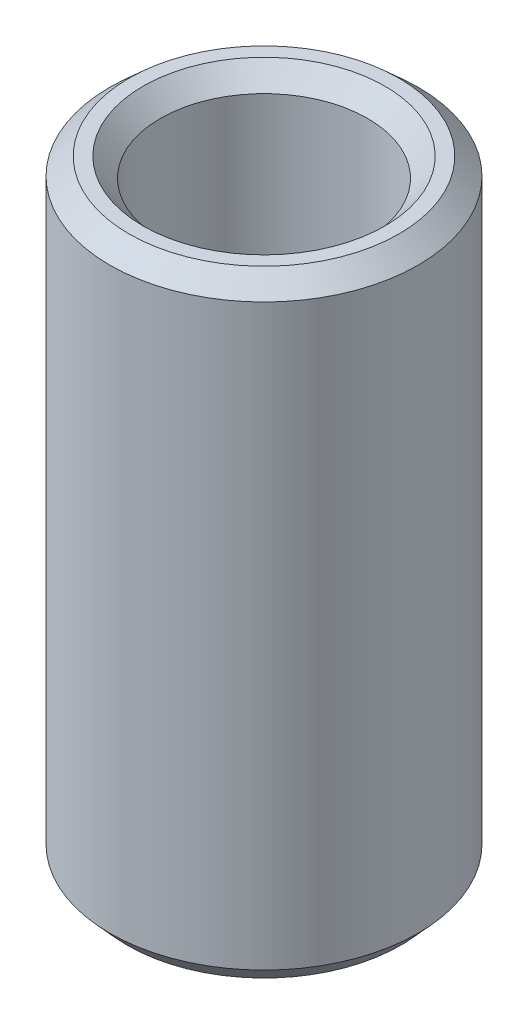
ISO-10303-21;
HEADER;
FILE_DESCRIPTION(('STEP AP214'),'2;1');
FILE_NAME('part.step','',(''),(''),'','','');
FILE_SCHEMA(('AUTOMOTIVE_DESIGN { 1 0 10303 214 1 1 1 1 }'));
ENDSEC;
DATA;
#1=APPLICATION_CONTEXT('core data for automotive mechanical design processes');
#2=APPLICATION_PROTOCOL_DEFINITION('international standard','automotive_design',2000,#1);
#3=PRODUCT_CONTEXT('',#1,'mechanical');
#4=PRODUCT('Part','Part','',(#3));
#5=PRODUCT_RELATED_PRODUCT_CATEGORY('part','',(#4));
#6=PRODUCT_DEFINITION_FORMATION('','',#4);
#7=PRODUCT_DEFINITION_CONTEXT('part definition',#1,'design');
#8=PRODUCT_DEFINITION('design','',#6,#7);
#9=PRODUCT_DEFINITION_SHAPE('','',#8);
#10=(LENGTH_UNIT() NAMED_UNIT(*) SI_UNIT(.MILLI.,.METRE.));
#11=(NAMED_UNIT(*) PLANE_ANGLE_UNIT() SI_UNIT($,.RADIAN.));
#12=(NAMED_UNIT(*) SI_UNIT($,.STERADIAN.) SOLID_ANGLE_UNIT());
#13=UNCERTAINTY_MEASURE_WITH_UNIT(LENGTH_MEASURE(1.E-05),#10,'distance_accuracy_value','');
#14=(GEOMETRIC_REPRESENTATION_CONTEXT(3) GLOBAL_UNCERTAINTY_ASSIGNED_CONTEXT((#13)) GLOBAL_UNIT_ASSIGNED_CONTEXT((#10,
#11,#12)) REPRESENTATION_CONTEXT('',''));
#15=CARTESIAN_POINT('',(0.,0.,0.));
#16=DIRECTION('',(0.,0.,1.));
#17=DIRECTION('',(1.,0.,0.));
#18=AXIS2_PLACEMENT_3D('',#15,#16,#17);
#19=CARTESIAN_POINT('',(0.,119.736719964159,0.));
#20=DIRECTION('',(0.,-1.,0.));
#21=DIRECTION('',(0.,0.,-1.));
#22=AXIS2_PLACEMENT_3D('',#19,#20,#21);
#23=CYLINDRICAL_SURFACE('',#22,30.);
#24=CARTESIAN_POINT('',(0.,3.7350255753613,0.));
#25=DIRECTION('',(0.,1.,0.));
#26=DIRECTION('',(0.,0.,1.));
#27=AXIS2_PLACEMENT_3D('',#24,#25,#26);
#28=CIRCLE('',#27,30.);
#29=CARTESIAN_POINT('',(0.,3.73502557536129,-30.));
#30=VERTEX_POINT('',#29);
#31=EDGE_CURVE('E10',#30,#30,#28,.T.);
#32=CARTESIAN_POINT('',(0.,116.346304996092,0.));
#33=DIRECTION('',(0.,1.,0.));
#34=DIRECTION('',(0.,0.,1.));
#35=AXIS2_PLACEMENT_3D('',#32,#33,#34);
#36=CIRCLE('',#35,30.);
#37=CARTESIAN_POINT('',(0.,116.346304996092,-30.));
#38=VERTEX_POINT('',#37);
#39=EDGE_CURVE('E50',#38,#38,#36,.F.);
#40=CARTESIAN_POINT('',(0.,3.73502557536129,-30.));
#41=CARTESIAN_POINT('',(0.,4.90805973599389,-30.));
#42=CARTESIAN_POINT('',(0.,6.0810938966265,-30.));
#43=CARTESIAN_POINT('',(0.,8.42716221789172,-30.));
#44=CARTESIAN_POINT('',(0.,9.60019637852433,-30.));
#45=CARTESIAN_POINT('',(0.,11.9462646997895,-30.));
#46=CARTESIAN_POINT('',(0.,13.1192988604222,-30.));
#47=CARTESIAN_POINT('',(0.,15.4653671816874,-30.));
#48=CARTESIAN_POINT('',(0.,16.63840134232,-30.));
#49=CARTESIAN_POINT('',(0.,18.9844696635852,-30.));
#50=CARTESIAN_POINT('',(0.,20.1575038242178,-30.));
#51=CARTESIAN_POINT('',(0.,22.503572145483,-30.));
#52=CARTESIAN_POINT('',(0.,23.6766063061156,-30.));
#53=CARTESIAN_POINT('',(0.,26.0226746273809,-30.));
#54=CARTESIAN_POINT('',(0.,27.1957087880135,-30.));
#55=CARTESIAN_POINT('',(0.,29.5417771092787,-30.));
#56=CARTESIAN_POINT('',(0.,30.7148112699113,-30.));
#57=CARTESIAN_POINT('',(0.,33.0608795911765,-30.));
#58=CARTESIAN_POINT('',(0.,34.2339137518091,-30.));
#59=CARTESIAN_POINT('',(0.,36.5799820730743,-30.));
#60=CARTESIAN_POINT('',(0.,37.7530162337069,-30.));
#61=CARTESIAN_POINT('',(0.,40.0990845549722,-30.));
#62=CARTESIAN_POINT('',(0.,41.2721187156048,-30.));
#63=CARTESIAN_POINT('',(0.,43.61818703687,-30.));
#64=CARTESIAN_POINT('',(0.,44.7912211975026,-30.));
#65=CARTESIAN_POINT('',(0.,47.1372895187678,-30.));
#66=CARTESIAN_POINT('',(0.,48.3103236794004,-30.));
#67=CARTESIAN_POINT('',(0.,50.6563920006656,-30.));
#68=CARTESIAN_POINT('',(0.,51.8294261612982,-30.));
#69=CARTESIAN_POINT('',(0.,54.1754944825635,-30.));
#70=CARTESIAN_POINT('',(0.,55.3485286431961,-30.));
#71=CARTESIAN_POINT('',(0.,57.6945969644613,-30.));
#72=CARTESIAN_POINT('',(0.,58.8676311250939,-30.));
#73=CARTESIAN_POINT('',(0.,61.2136994463591,-30.));
#74=CARTESIAN_POINT('',(0.,62.3867336069917,-30.));
#75=CARTESIAN_POINT('',(0.,64.7328019282569,-30.));
#76=CARTESIAN_POINT('',(0.,65.9058360888895,-30.));
#77=CARTESIAN_POINT('',(0.,68.2519044101548,-30.));
#78=CARTESIAN_POINT('',(0.,69.4249385707874,-30.));
#79=CARTESIAN_POINT('',(0.,71.7710068920526,-30.));
#80=CARTESIAN_POINT('',(0.,72.9440410526852,-30.));
#81=CARTESIAN_POINT('',(0.,75.2901093739504,-30.));
#82=CARTESIAN_POINT('',(0.,76.463143534583,-30.));
#83=CARTESIAN_POINT('',(0.,78.8092118558482,-30.));
#84=CARTESIAN_POINT('',(0.,79.9822460164809,-30.));
#85=CARTESIAN_POINT('',(0.,82.3283143377461,-30.));
#86=CARTESIAN_POINT('',(0.,83.5013484983787,-30.));
#87=CARTESIAN_POINT('',(0.,85.8474168196439,-30.));
#88=CARTESIAN_POINT('',(0.,87.0204509802765,-30.));
#89=CARTESIAN_POINT('',(0.,89.3665193015417,-30.));
#90=CARTESIAN_POINT('',(0.,90.5395534621743,-30.));
#91=CARTESIAN_POINT('',(0.,92.8856217834395,-30.));
#92=CARTESIAN_POINT('',(0.,94.0586559440721,-30.));
#93=CARTESIAN_POINT('',(0.,96.4047242653374,-30.));
#94=CARTESIAN_POINT('',(0.,97.57775842597,-30.));
#95=CARTESIAN_POINT('',(0.,99.9238267472352,-30.));
#96=CARTESIAN_POINT('',(0.,101.096860907868,-30.));
#97=CARTESIAN_POINT('',(0.,103.442929229133,-30.));
#98=CARTESIAN_POINT('',(0.,104.615963389766,-30.));
#99=CARTESIAN_POINT('',(0.,106.962031711031,-30.));
#100=CARTESIAN_POINT('',(0.,108.135065871663,-30.));
#101=CARTESIAN_POINT('',(0.,110.481134192929,-30.));
#102=CARTESIAN_POINT('',(0.,111.654168353561,-30.));
#103=CARTESIAN_POINT('',(0.,114.000236674826,-30.));
#104=CARTESIAN_POINT('',(0.,115.173270835459,-30.));
#105=CARTESIAN_POINT('',(0.,116.346304996092,-30.));
#106=B_SPLINE_CURVE_WITH_KNOTS('',3,(#40,#41,#42,#43,#44,#45,#46,#47,#48,#49,#50,#51,#52,#53,
#54,#55,#56,#57,#58,#59,#60,#61,#62,#63,#64,#65,#66,#67,#68,#69,#70,#71,#72,#73,#74,#75,#76,#77,
#78,#79,#80,#81,#82,#83,#84,#85,#86,#87,#88,#89,#90,#91,#92,#93,#94,#95,#96,#97,#98,#99,#100,
#101,#102,#103,#104,#105),.UNSPECIFIED.,.F.,.F.,(4,2,2,2,2,2,2,2,2,2,2,2,2,2,2,2,2,2,2,2,2,2,2,
2,2,2,2,2,2,2,2,2,4),(0.,3.51910248189782,7.03820496379565,10.5573074456935,14.0764099275913,
17.5955124094891,21.114614891387,24.6337173732848,28.1528198551826,31.6719223370804,
35.1910248189783,38.7101273008761,42.2292297827739,45.7483322646717,49.2674347465696,
52.7865372284674,56.3056397103652,59.824742192263,63.3438446741608,66.8629471560587,
70.3820496379565,73.9011521198543,77.4202546017522,80.93935708365,84.4584595655478,
87.9775620474456,91.4966645293435,95.0157670112413,98.5348694931391,102.053971975037,
105.573074456935,109.092176938833,112.61127942073),.UNSPECIFIED.);
#107=EDGE_CURVE('BSEAM39',#30,#38,#106,.T.);
#108=ORIENTED_EDGE('',*,*,#31,.T.);
#109=ORIENTED_EDGE('',*,*,#39,.T.);
#110=ORIENTED_EDGE('',*,*,#107,.T.);
#111=ORIENTED_EDGE('',*,*,#107,.F.);
#112=EDGE_LOOP('',(#108,#110,#109,#111));
#113=FACE_BOUND('',#112,.T.);
#114=ADVANCED_FACE('F39',(#113),#23,.T.);
#115=CARTESIAN_POINT('',(0.,119.736719964159,0.));
#116=DIRECTION('',(0.,1.,0.));
#117=DIRECTION('',(0.,0.,1.));
#118=AXIS2_PLACEMENT_3D('',#115,#116,#117);
#119=PLANE('',#118);
#120=CARTESIAN_POINT('',(0.,119.736719964159,0.));
#121=DIRECTION('',(0.,1.,0.));
#122=DIRECTION('',(0.,0.,1.));
#123=AXIS2_PLACEMENT_3D('',#120,#121,#122);
#124=CIRCLE('',#123,23.5586092635008);
#125=CARTESIAN_POINT('',(0.,119.736719964159,23.5586092635008));
#126=VERTEX_POINT('',#125);
#127=EDGE_CURVE('E58',#126,#126,#124,.F.);
#128=ORIENTED_EDGE('',*,*,#127,.T.);
#129=EDGE_LOOP('',(#128));
#130=FACE_BOUND('',#129,.T.);
#131=CARTESIAN_POINT('',(0.,119.736719964159,0.));
#132=DIRECTION('',(0.,1.,0.));
#133=DIRECTION('',(0.,0.,1.));
#134=AXIS2_PLACEMENT_3D('',#131,#132,#133);
#135=CIRCLE('',#134,26.2649744246389);
#136=CARTESIAN_POINT('',(0.,119.736719964159,26.2649744246389));
#137=VERTEX_POINT('',#136);
#138=EDGE_CURVE('E61',#137,#137,#135,.T.);
#139=ORIENTED_EDGE('',*,*,#138,.T.);
#140=EDGE_LOOP('',(#139));
#141=FACE_BOUND('',#140,.T.);
#142=ADVANCED_FACE('F88',(#130,#141),#119,.T.);
#143=CARTESIAN_POINT('',(0.,0.,0.));
#144=DIRECTION('',(0.,1.,0.));
#145=DIRECTION('',(0.,0.,1.));
#146=AXIS2_PLACEMENT_3D('',#143,#144,#145);
#147=PLANE('',#146);
#148=CARTESIAN_POINT('',(0.,0.,0.));
#149=DIRECTION('',(0.,1.,0.));
#150=DIRECTION('',(0.,0.,1.));
#151=AXIS2_PLACEMENT_3D('',#148,#149,#150);
#152=CIRCLE('',#151,23.903219870795);
#153=CARTESIAN_POINT('',(0.,0.,-23.903219870795));
#154=VERTEX_POINT('',#153);
#155=EDGE_CURVE('E51',#154,#154,#152,.T.);
#156=ORIENTED_EDGE('',*,*,#155,.T.);
#157=EDGE_LOOP('',(#156));
#158=FACE_BOUND('',#157,.T.);
#159=CARTESIAN_POINT('',(0.,0.,0.));
#160=DIRECTION('',(0.,1.,0.));
#161=DIRECTION('',(0.,0.,1.));
#162=AXIS2_PLACEMENT_3D('',#159,#160,#161);
#163=CIRCLE('',#162,26.6095850319329);
#164=CARTESIAN_POINT('',(0.,0.,26.6095850319329));
#165=VERTEX_POINT('',#164);
#166=EDGE_CURVE('E54',#165,#165,#163,.F.);
#167=ORIENTED_EDGE('',*,*,#166,.T.);
#168=EDGE_LOOP('',(#167));
#169=FACE_BOUND('',#168,.T.);
#170=ADVANCED_FACE('F83',(#158,#169),#147,.F.);
#171=CARTESIAN_POINT('',(0.,119.736719964159,0.));
#172=DIRECTION('',(0.,-1.,0.));
#173=DIRECTION('',(0.,0.,-1.));
#174=AXIS2_PLACEMENT_3D('',#171,#172,#173);
#175=CYLINDRICAL_SURFACE('',#174,20.1681942954338);
#176=CARTESIAN_POINT('',(0.,116.001694388797,0.));
#177=DIRECTION('',(0.,1.,0.));
#178=DIRECTION('',(0.,0.,1.));
#179=AXIS2_PLACEMENT_3D('',#176,#177,#178);
#180=CIRCLE('',#179,20.1681942954338);
#181=CARTESIAN_POINT('',(0.,116.001694388797,-20.1681942954338));
#182=VERTEX_POINT('',#181);
#183=EDGE_CURVE('E67',#182,#182,#180,.T.);
#184=CARTESIAN_POINT('',(0.,3.390414968067,0.));
#185=DIRECTION('',(0.,1.,0.));
#186=DIRECTION('',(0.,0.,1.));
#187=AXIS2_PLACEMENT_3D('',#184,#185,#186);
#188=CIRCLE('',#187,20.1681942954338);
#189=CARTESIAN_POINT('',(0.,3.390414968067,-20.1681942954338));
#190=VERTEX_POINT('',#189);
#191=EDGE_CURVE('E69',#190,#190,#188,.F.);
#192=CARTESIAN_POINT('',(0.,116.001694388797,-20.1681942954338));
#193=CARTESIAN_POINT('',(0.,114.828660228165,-20.1681942954338));
#194=CARTESIAN_POINT('',(0.,113.655626067532,-20.1681942954338));
#195=CARTESIAN_POINT('',(0.,111.309557746267,-20.1681942954338));
#196=CARTESIAN_POINT('',(0.,110.136523585634,-20.1681942954338));
#197=CARTESIAN_POINT('',(0.,107.790455264369,-20.1681942954338));
#198=CARTESIAN_POINT('',(0.,106.617421103736,-20.1681942954338));
#199=CARTESIAN_POINT('',(0.,104.271352782471,-20.1681942954338));
#200=CARTESIAN_POINT('',(0.,103.098318621839,-20.1681942954338));
#201=CARTESIAN_POINT('',(0.,100.752250300573,-20.1681942954338));
#202=CARTESIAN_POINT('',(0.,99.5792161399408,-20.1681942954338));
#203=CARTESIAN_POINT('',(0.,97.2331478186756,-20.1681942954338));
#204=CARTESIAN_POINT('',(0.,96.060113658043,-20.1681942954338));
#205=CARTESIAN_POINT('',(0.,93.7140453367778,-20.1681942954338));
#206=CARTESIAN_POINT('',(0.,92.5410111761452,-20.1681942954338));
#207=CARTESIAN_POINT('',(0.,90.19494285488,-20.1681942954338));
#208=CARTESIAN_POINT('',(0.,89.0219086942474,-20.1681942954338));
#209=CARTESIAN_POINT('',(0.,86.6758403729822,-20.1681942954338));
#210=CARTESIAN_POINT('',(0.,85.5028062123495,-20.1681942954338));
#211=CARTESIAN_POINT('',(0.,83.1567378910843,-20.1681942954338));
#212=CARTESIAN_POINT('',(0.,81.9837037304517,-20.1681942954338));
#213=CARTESIAN_POINT('',(0.,79.6376354091865,-20.1681942954338));
#214=CARTESIAN_POINT('',(0.,78.4646012485539,-20.1681942954338));
#215=CARTESIAN_POINT('',(0.,76.1185329272887,-20.1681942954338));
#216=CARTESIAN_POINT('',(0.,74.9454987666561,-20.1681942954338));
#217=CARTESIAN_POINT('',(0.,72.5994304453909,-20.1681942954338));
#218=CARTESIAN_POINT('',(0.,71.4263962847583,-20.1681942954338));
#219=CARTESIAN_POINT('',(0.,69.080327963493,-20.1681942954338));
#220=CARTESIAN_POINT('',(0.,67.9072938028604,-20.1681942954338));
#221=CARTESIAN_POINT('',(0.,65.5612254815952,-20.1681942954338));
#222=CARTESIAN_POINT('',(0.,64.3881913209626,-20.1681942954338));
#223=CARTESIAN_POINT('',(0.,62.0421229996974,-20.1681942954338));
#224=CARTESIAN_POINT('',(0.,60.8690888390648,-20.1681942954338));
#225=CARTESIAN_POINT('',(0.,58.5230205177996,-20.1681942954338));
#226=CARTESIAN_POINT('',(0.,57.349986357167,-20.1681942954338));
#227=CARTESIAN_POINT('',(0.,55.0039180359017,-20.1681942954338));
#228=CARTESIAN_POINT('',(0.,53.8308838752691,-20.1681942954338));
#229=CARTESIAN_POINT('',(0.,51.4848155540039,-20.1681942954338));
#230=CARTESIAN_POINT('',(0.,50.3117813933713,-20.1681942954338));
#231=CARTESIAN_POINT('',(0.,47.9657130721061,-20.1681942954338));
#232=CARTESIAN_POINT('',(0.,46.7926789114735,-20.1681942954338));
#233=CARTESIAN_POINT('',(0.,44.4466105902083,-20.1681942954338));
#234=CARTESIAN_POINT('',(0.,43.2735764295757,-20.1681942954338));
#235=CARTESIAN_POINT('',(0.,40.9275081083104,-20.1681942954338));
#236=CARTESIAN_POINT('',(0.,39.7544739476778,-20.1681942954338));
#237=CARTESIAN_POINT('',(0.,37.4084056264126,-20.1681942954338));
#238=CARTESIAN_POINT('',(0.,36.23537146578,-20.1681942954338));
#239=CARTESIAN_POINT('',(0.,33.8893031445148,-20.1681942954338));
#240=CARTESIAN_POINT('',(0.,32.7162689838822,-20.1681942954338));
#241=CARTESIAN_POINT('',(0.,30.370200662617,-20.1681942954338));
#242=CARTESIAN_POINT('',(0.,29.1971665019844,-20.1681942954338));
#243=CARTESIAN_POINT('',(0.,26.8510981807192,-20.1681942954338));
#244=CARTESIAN_POINT('',(0.,25.6780640200865,-20.1681942954338));
#245=CARTESIAN_POINT('',(0.,23.3319956988213,-20.1681942954338));
#246=CARTESIAN_POINT('',(0.,22.1589615381887,-20.1681942954338));
#247=CARTESIAN_POINT('',(0.,19.8128932169235,-20.1681942954338));
#248=CARTESIAN_POINT('',(0.,18.6398590562909,-20.1681942954338));
#249=CARTESIAN_POINT('',(0.,16.2937907350257,-20.1681942954338));
#250=CARTESIAN_POINT('',(0.,15.1207565743931,-20.1681942954338));
#251=CARTESIAN_POINT('',(0.,12.7746882531279,-20.1681942954338));
#252=CARTESIAN_POINT('',(0.,11.6016540924953,-20.1681942954338));
#253=CARTESIAN_POINT('',(0.,9.25558577123003,-20.1681942954338));
#254=CARTESIAN_POINT('',(0.,8.08255161059743,-20.1681942954338));
#255=CARTESIAN_POINT('',(0.,5.73648328933221,-20.1681942954338));
#256=CARTESIAN_POINT('',(0.,4.5634491286996,-20.1681942954338));
#257=CARTESIAN_POINT('',(0.,3.390414968067,-20.1681942954338));
#258=B_SPLINE_CURVE_WITH_KNOTS('',3,(#192,#193,#194,#195,#196,#197,#198,#199,#200,#201,#202,
#203,#204,#205,#206,#207,#208,#209,#210,#211,#212,#213,#214,#215,#216,#217,#218,#219,#220,#221,
#222,#223,#224,#225,#226,#227,#228,#229,#230,#231,#232,#233,#234,#235,#236,#237,#238,#239,#240,
#241,#242,#243,#244,#245,#246,#247,#248,#249,#250,#251,#252,#253,#254,#255,#256,#257),
.UNSPECIFIED.,.F.,.F.,(4,2,2,2,2,2,2,2,2,2,2,2,2,2,2,2,2,2,2,2,2,2,2,2,2,2,2,2,2,2,2,2,4),(0.,
3.51910248189784,7.03820496379566,10.5573074456935,14.0764099275913,17.5955124094891,
21.114614891387,24.6337173732848,28.1528198551826,31.6719223370804,35.1910248189782,
38.7101273008761,42.2292297827739,45.7483322646717,49.2674347465695,52.7865372284674,
56.3056397103652,59.824742192263,63.3438446741608,66.8629471560587,70.3820496379565,
73.9011521198543,77.4202546017521,80.93935708365,84.4584595655478,87.9775620474456,
91.4966645293434,95.0157670112413,98.5348694931391,102.053971975037,105.573074456935,
109.092176938833,112.61127942073),.UNSPECIFIED.);
#259=EDGE_CURVE('BSEAM71',#182,#190,#258,.T.);
#260=ORIENTED_EDGE('',*,*,#183,.T.);
#261=ORIENTED_EDGE('',*,*,#191,.T.);
#262=ORIENTED_EDGE('',*,*,#259,.T.);
#263=ORIENTED_EDGE('',*,*,#259,.F.);
#264=EDGE_LOOP('',(#260,#262,#261,#263));
#265=FACE_BOUND('',#264,.T.);
#266=ADVANCED_FACE('F71',(#265),#175,.F.);
#267=CARTESIAN_POINT('',(0.,116.001694388797,0.));
#268=DIRECTION('',(0.,1.,0.));
#269=DIRECTION('',(0.,0.,1.));
#270=AXIS2_PLACEMENT_3D('',#267,#268,#269);
#271=CONICAL_SURFACE('',#270,20.1681942954338,0.737072407537471);
#272=ORIENTED_EDGE('',*,*,#127,.F.);
#273=EDGE_LOOP('',(#272));
#274=FACE_BOUND('',#273,.T.);
#275=ORIENTED_EDGE('',*,*,#183,.F.);
#276=EDGE_LOOP('',(#275));
#277=FACE_BOUND('',#276,.T.);
#278=ADVANCED_FACE('F77',(#274,#277),#271,.F.);
#279=CARTESIAN_POINT('',(0.,0.,0.));
#280=DIRECTION('',(0.,-1.,0.));
#281=DIRECTION('',(0.,0.,-1.));
#282=AXIS2_PLACEMENT_3D('',#279,#280,#281);
#283=CONICAL_SURFACE('',#282,23.903219870795,0.833723919257426);
#284=CARTESIAN_POINT('',(0.,3.390414968067,-20.1681942954338));
#285=CARTESIAN_POINT('',(0.,3.35509814548296,-20.2071008118438));
#286=CARTESIAN_POINT('',(0.,3.31978132289893,-20.2460073282538));
#287=CARTESIAN_POINT('',(0.,3.24914767773087,-20.3238203610738));
#288=CARTESIAN_POINT('',(0.,3.21383085514684,-20.3627268774838));
#289=CARTESIAN_POINT('',(0.,3.14319720997878,-20.4405399103038));
#290=CARTESIAN_POINT('',(0.,3.10788038739475,-20.4794464267139));
#291=CARTESIAN_POINT('',(0.,3.03724674222668,-20.5572594595339));
#292=CARTESIAN_POINT('',(0.,3.00192991964265,-20.5961659759439));
#293=CARTESIAN_POINT('',(0.,2.93129627447459,-20.6739790087639));
#294=CARTESIAN_POINT('',(0.,2.89597945189056,-20.7128855251739));
#295=CARTESIAN_POINT('',(0.,2.8253458067225,-20.790698557994));
#296=CARTESIAN_POINT('',(0.,2.79002898413847,-20.829605074404));
#297=CARTESIAN_POINT('',(0.,2.7193953389704,-20.907418107224));
#298=CARTESIAN_POINT('',(0.,2.68407851638637,-20.946324623634));
#299=CARTESIAN_POINT('',(0.,2.61344487121831,-21.024137656454));
#300=CARTESIAN_POINT('',(0.,2.57812804863428,-21.063044172864));
#301=CARTESIAN_POINT('',(0.,2.50749440346621,-21.1408572056841));
#302=CARTESIAN_POINT('',(0.,2.47217758088218,-21.1797637220941));
#303=CARTESIAN_POINT('',(0.,2.40154393571412,-21.2575767549141));
#304=CARTESIAN_POINT('',(0.,2.36622711313009,-21.2964832713241));
#305=CARTESIAN_POINT('',(0.,2.29559346796203,-21.3742963041441));
#306=CARTESIAN_POINT('',(0.,2.260276645378,-21.4132028205542));
#307=CARTESIAN_POINT('',(0.,2.18964300020993,-21.4910158533742));
#308=CARTESIAN_POINT('',(0.,2.1543261776259,-21.5299223697842));
#309=CARTESIAN_POINT('',(0.,2.08369253245784,-21.6077354026042));
#310=CARTESIAN_POINT('',(0.,2.04837570987381,-21.6466419190142));
#311=CARTESIAN_POINT('',(0.,1.97774206470575,-21.7244549518343));
#312=CARTESIAN_POINT('',(0.,1.94242524212172,-21.7633614682443));
#313=CARTESIAN_POINT('',(0.,1.87179159695365,-21.8411745010643));
#314=CARTESIAN_POINT('',(0.,1.83647477436962,-21.8800810174743));
#315=CARTESIAN_POINT('',(0.,1.76584112920156,-21.9578940502943));
#316=CARTESIAN_POINT('',(0.,1.73052430661753,-21.9968005667043));
#317=CARTESIAN_POINT('',(0.,1.65989066144947,-22.0746135995244));
#318=CARTESIAN_POINT('',(0.,1.62457383886544,-22.1135201159344));
#319=CARTESIAN_POINT('',(0.,1.55394019369737,-22.1913331487544));
#320=CARTESIAN_POINT('',(0.,1.51862337111334,-22.2302396651644));
#321=CARTESIAN_POINT('',(0.,1.44798972594528,-22.3080526979845));
#322=CARTESIAN_POINT('',(0.,1.41267290336125,-22.3469592143945));
#323=CARTESIAN_POINT('',(0.,1.34203925819319,-22.4247722472145));
#324=CARTESIAN_POINT('',(0.,1.30672243560915,-22.4636787636245));
#325=CARTESIAN_POINT('',(0.,1.23608879044109,-22.5414917964445));
#326=CARTESIAN_POINT('',(0.,1.20077196785706,-22.5803983128545));
#327=CARTESIAN_POINT('',(0.,1.130138322689,-22.6582113456746));
#328=CARTESIAN_POINT('',(0.,1.09482150010497,-22.6971178620846));
#329=CARTESIAN_POINT('',(0.,1.0241878549369,-22.7749308949046));
#330=CARTESIAN_POINT('',(0.,0.988871032352874,-22.8138374113146));
#331=CARTESIAN_POINT('',(0.,0.918237387184811,-22.8916504441346));
#332=CARTESIAN_POINT('',(0.,0.88292056460078,-22.9305569605446));
#333=CARTESIAN_POINT('',(0.,0.812286919432718,-23.0083699933647));
#334=CARTESIAN_POINT('',(0.,0.776970096848686,-23.0472765097747));
#335=CARTESIAN_POINT('',(0.,0.706336451680624,-23.1250895425947));
#336=CARTESIAN_POINT('',(0.,0.671019629096593,-23.1639960590047));
#337=CARTESIAN_POINT('',(0.,0.60038598392853,-23.2418090918248));
#338=CARTESIAN_POINT('',(0.,0.565069161344499,-23.2807156082348));
#339=CARTESIAN_POINT('',(0.,0.494435516176437,-23.3585286410548));
#340=CARTESIAN_POINT('',(0.,0.459118693592406,-23.3974351574648));
#341=CARTESIAN_POINT('',(0.,0.388485048424343,-23.4752481902848));
#342=CARTESIAN_POINT('',(0.,0.353168225840312,-23.5141547066948));
#343=CARTESIAN_POINT('',(0.,0.28253458067225,-23.5919677395149));
#344=CARTESIAN_POINT('',(0.,0.247217758088218,-23.6308742559249));
#345=CARTESIAN_POINT('',(0.,0.176584112920156,-23.7086872887449));
#346=CARTESIAN_POINT('',(0.,0.141267290336125,-23.7475938051549));
#347=CARTESIAN_POINT('',(0.,0.0706336451680624,-23.8254068379749));
#348=CARTESIAN_POINT('',(0.,0.0353168225840312,-23.864313354385));
#349=CARTESIAN_POINT('',(0.,0.,-23.903219870795));
#350=B_SPLINE_CURVE_WITH_KNOTS('',3,(#284,#285,#286,#287,#288,#289,#290,#291,#292,#293,#294,
#295,#296,#297,#298,#299,#300,#301,#302,#303,#304,#305,#306,#307,#308,#309,#310,#311,#312,#313,
#314,#315,#316,#317,#318,#319,#320,#321,#322,#323,#324,#325,#326,#327,#328,#329,#330,#331,#332,
#333,#334,#335,#336,#337,#338,#339,#340,#341,#342,#343,#344,#345,#346,#347,#348,#349),
.UNSPECIFIED.,.F.,.F.,(4,2,2,2,2,2,2,2,2,2,2,2,2,2,2,2,2,2,2,2,2,2,2,2,2,2,2,2,2,2,2,2,4),(0.,
0.157635512462613,0.315271024925226,0.472906537387839,0.630542049850452,0.788177562313065,
0.945813074775678,1.10344858723829,1.2610840997009,1.41871961216352,1.57635512462613,
1.73399063708874,1.89162614955136,2.04926166201397,2.20689717447658,2.3645326869392,
2.52216819940181,2.67980371186442,2.83743922432703,2.99507473678965,3.15271024925226,
3.31034576171487,3.46798127417749,3.6256167866401,3.78325229910271,3.94088781156532,
4.09852332402794,4.25615883649055,4.41379434895316,4.57142986141578,4.72906537387839,
4.886700886341,5.04433639880361),.UNSPECIFIED.);
#351=EDGE_CURVE('BSEAM73',#190,#154,#350,.T.);
#352=ORIENTED_EDGE('',*,*,#191,.F.);
#353=ORIENTED_EDGE('',*,*,#155,.F.);
#354=ORIENTED_EDGE('',*,*,#351,.T.);
#355=ORIENTED_EDGE('',*,*,#351,.F.);
#356=EDGE_LOOP('',(#352,#354,#353,#355));
#357=FACE_BOUND('',#356,.T.);
#358=ADVANCED_FACE('F73',(#357),#283,.F.);
#359=CARTESIAN_POINT('',(0.,3.7350255753613,0.));
#360=DIRECTION('',(0.,1.,0.));
#361=DIRECTION('',(0.,0.,1.));
#362=AXIS2_PLACEMENT_3D('',#359,#360,#361);
#363=CONICAL_SURFACE('',#362,30.,0.73707240753747);
#364=ORIENTED_EDGE('',*,*,#166,.F.);
#365=EDGE_LOOP('',(#364));
#366=FACE_BOUND('',#365,.T.);
#367=ORIENTED_EDGE('',*,*,#31,.F.);
#368=EDGE_LOOP('',(#367));
#369=FACE_BOUND('',#368,.T.);
#370=ADVANCED_FACE('F76',(#366,#369),#363,.T.);
#371=CARTESIAN_POINT('',(0.,119.736719964159,0.));
#372=DIRECTION('',(0.,-1.,0.));
#373=DIRECTION('',(0.,0.,-1.));
#374=AXIS2_PLACEMENT_3D('',#371,#372,#373);
#375=CONICAL_SURFACE('',#374,26.2649744246389,0.833723919257428);
#376=ORIENTED_EDGE('',*,*,#39,.F.);
#377=EDGE_LOOP('',(#376));
#378=FACE_BOUND('',#377,.T.);
#379=ORIENTED_EDGE('',*,*,#138,.F.);
#380=EDGE_LOOP('',(#379));
#381=FACE_BOUND('',#380,.T.);
#382=ADVANCED_FACE('F45',(#378,#381),#375,.T.);
#383=CLOSED_SHELL('',(#114,#142,#170,#266,#278,#358,#370,#382));
#384=MANIFOLD_SOLID_BREP('B2',#383);
#385=ADVANCED_BREP_SHAPE_REPRESENTATION('',(#18,#384),#14);
#386=SHAPE_DEFINITION_REPRESENTATION(#9,#385);
ENDSEC;
END-ISO-10303-21;
